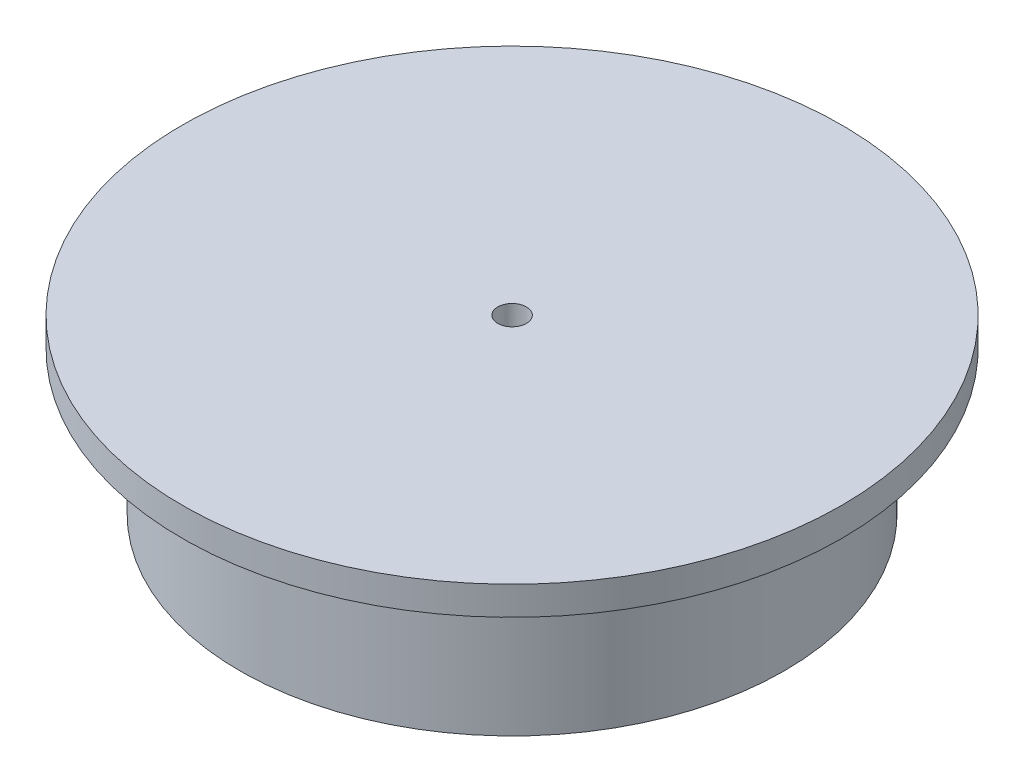
ISO-10303-21;
HEADER;
FILE_DESCRIPTION(('STEP AP214'),'2;1');
FILE_NAME('part.step','',(''),(''),'','','');
FILE_SCHEMA(('AUTOMOTIVE_DESIGN { 1 0 10303 214 1 1 1 1 }'));
ENDSEC;
DATA;
#1=APPLICATION_CONTEXT('core data for automotive mechanical design processes');
#2=APPLICATION_PROTOCOL_DEFINITION('international standard','automotive_design',2000,#1);
#3=PRODUCT_CONTEXT('',#1,'mechanical');
#4=PRODUCT('Part','Part','',(#3));
#5=PRODUCT_RELATED_PRODUCT_CATEGORY('part','',(#4));
#6=PRODUCT_DEFINITION_FORMATION('','',#4);
#7=PRODUCT_DEFINITION_CONTEXT('part definition',#1,'design');
#8=PRODUCT_DEFINITION('design','',#6,#7);
#9=PRODUCT_DEFINITION_SHAPE('','',#8);
#10=(LENGTH_UNIT() NAMED_UNIT(*) SI_UNIT(.MILLI.,.METRE.));
#11=(NAMED_UNIT(*) PLANE_ANGLE_UNIT() SI_UNIT($,.RADIAN.));
#12=(NAMED_UNIT(*) SI_UNIT($,.STERADIAN.) SOLID_ANGLE_UNIT());
#13=UNCERTAINTY_MEASURE_WITH_UNIT(LENGTH_MEASURE(1.E-05),#10,'distance_accuracy_value','');
#14=(GEOMETRIC_REPRESENTATION_CONTEXT(3) GLOBAL_UNCERTAINTY_ASSIGNED_CONTEXT((#13)) GLOBAL_UNIT_ASSIGNED_CONTEXT((#10,
#11,#12)) REPRESENTATION_CONTEXT('',''));
#15=CARTESIAN_POINT('',(0.,0.,0.));
#16=DIRECTION('',(0.,0.,1.));
#17=DIRECTION('',(1.,0.,0.));
#18=AXIS2_PLACEMENT_3D('',#15,#16,#17);
#19=CARTESIAN_POINT('',(0.,40.6119309075886,0.));
#20=DIRECTION('',(0.,-1.,0.));
#21=DIRECTION('',(1.,0.,0.));
#22=AXIS2_PLACEMENT_3D('',#19,#20,#21);
#23=CYLINDRICAL_SURFACE('',#22,57.5);
#24=CARTESIAN_POINT('',(0.,35.6119309075886,0.));
#25=DIRECTION('',(0.,-1.,0.));
#26=DIRECTION('',(1.,0.,0.));
#27=AXIS2_PLACEMENT_3D('',#24,#25,#26);
#28=CIRCLE('',#27,57.5);
#29=CARTESIAN_POINT('',(57.5,35.6119309075886,0.));
#30=VERTEX_POINT('',#29);
#31=EDGE_CURVE('E10',#30,#30,#28,.T.);
#32=ORIENTED_EDGE('',*,*,#31,.F.);
#33=EDGE_LOOP('',(#32));
#34=FACE_BOUND('',#33,.T.);
#35=CARTESIAN_POINT('',(0.,40.6119309075886,0.));
#36=DIRECTION('',(0.,-1.,0.));
#37=DIRECTION('',(1.,0.,0.));
#38=AXIS2_PLACEMENT_3D('',#35,#36,#37);
#39=CIRCLE('',#38,57.5);
#40=CARTESIAN_POINT('',(57.5,40.6119309075886,0.));
#41=VERTEX_POINT('',#40);
#42=EDGE_CURVE('E79',#41,#41,#39,.T.);
#43=ORIENTED_EDGE('',*,*,#42,.T.);
#44=EDGE_LOOP('',(#43));
#45=FACE_BOUND('',#44,.T.);
#46=ADVANCED_FACE('F44',(#34,#45),#23,.T.);
#47=CARTESIAN_POINT('',(0.,35.6119309075886,0.));
#48=DIRECTION('',(0.,1.,0.));
#49=DIRECTION('',(-1.,0.,0.));
#50=AXIS2_PLACEMENT_3D('',#47,#48,#49);
#51=PLANE('',#50);
#52=CARTESIAN_POINT('',(0.,35.6119309075886,0.));
#53=DIRECTION('',(0.,-1.,0.));
#54=DIRECTION('',(1.,0.,0.));
#55=AXIS2_PLACEMENT_3D('',#52,#53,#54);
#56=CIRCLE('',#55,47.5);
#57=CARTESIAN_POINT('',(47.5,35.6119309075886,0.));
#58=VERTEX_POINT('',#57);
#59=EDGE_CURVE('E52',#58,#58,#56,.T.);
#60=ORIENTED_EDGE('',*,*,#59,.F.);
#61=EDGE_LOOP('',(#60));
#62=FACE_BOUND('',#61,.T.);
#63=ORIENTED_EDGE('',*,*,#31,.T.);
#64=EDGE_LOOP('',(#63));
#65=FACE_BOUND('',#64,.T.);
#66=ADVANCED_FACE('F104',(#62,#65),#51,.F.);
#67=CARTESIAN_POINT('',(0.,40.6119309075886,0.));
#68=DIRECTION('',(0.,-1.,0.));
#69=DIRECTION('',(1.,0.,0.));
#70=AXIS2_PLACEMENT_3D('',#67,#68,#69);
#71=CYLINDRICAL_SURFACE('',#70,47.5);
#72=ORIENTED_EDGE('',*,*,#59,.T.);
#73=EDGE_LOOP('',(#72));
#74=FACE_BOUND('',#73,.T.);
#75=CARTESIAN_POINT('',(0.,10.6119309075886,0.));
#76=DIRECTION('',(0.,-1.,0.));
#77=DIRECTION('',(1.,0.,0.));
#78=AXIS2_PLACEMENT_3D('',#75,#76,#77);
#79=CIRCLE('',#78,47.5);
#80=CARTESIAN_POINT('',(47.5,10.6119309075886,0.));
#81=VERTEX_POINT('',#80);
#82=EDGE_CURVE('E57',#81,#81,#79,.T.);
#83=ORIENTED_EDGE('',*,*,#82,.F.);
#84=EDGE_LOOP('',(#83));
#85=FACE_BOUND('',#84,.T.);
#86=ADVANCED_FACE('F109',(#74,#85),#71,.T.);
#87=CARTESIAN_POINT('',(0.,10.6119309075886,0.));
#88=DIRECTION('',(0.,-1.,0.));
#89=DIRECTION('',(1.,0.,0.));
#90=AXIS2_PLACEMENT_3D('',#87,#88,#89);
#91=PLANE('',#90);
#92=ORIENTED_EDGE('',*,*,#82,.T.);
#93=EDGE_LOOP('',(#92));
#94=FACE_BOUND('',#93,.T.);
#95=CARTESIAN_POINT('',(0.,10.6119309075886,0.));
#96=DIRECTION('',(0.,-1.,0.));
#97=DIRECTION('',(1.,0.,0.));
#98=AXIS2_PLACEMENT_3D('',#95,#96,#97);
#99=CIRCLE('',#98,42.5);
#100=CARTESIAN_POINT('',(42.5,10.6119309075886,0.));
#101=VERTEX_POINT('',#100);
#102=EDGE_CURVE('E63',#101,#101,#99,.T.);
#103=ORIENTED_EDGE('',*,*,#102,.F.);
#104=EDGE_LOOP('',(#103));
#105=FACE_BOUND('',#104,.T.);
#106=ADVANCED_FACE('F116',(#94,#105),#91,.T.);
#107=CARTESIAN_POINT('',(0.,20.4880215522256,0.));
#108=DIRECTION('',(0.,-1.,0.));
#109=DIRECTION('',(1.,0.,0.));
#110=AXIS2_PLACEMENT_3D('',#107,#108,#109);
#111=CONICAL_SURFACE('',#110,32.623909355363,0.785398163397448);
#112=ORIENTED_EDGE('',*,*,#102,.T.);
#113=EDGE_LOOP('',(#112));
#114=FACE_BOUND('',#113,.T.);
#115=CARTESIAN_POINT('',(0.,20.4880215522256,0.));
#116=DIRECTION('',(0.,-1.,0.));
#117=DIRECTION('',(1.,0.,0.));
#118=AXIS2_PLACEMENT_3D('',#115,#116,#117);
#119=CIRCLE('',#118,32.623909355363);
#120=CARTESIAN_POINT('',(32.623909355363,20.4880215522256,0.));
#121=VERTEX_POINT('',#120);
#122=EDGE_CURVE('E67',#121,#121,#119,.T.);
#123=ORIENTED_EDGE('',*,*,#122,.F.);
#124=EDGE_LOOP('',(#123));
#125=FACE_BOUND('',#124,.T.);
#126=ADVANCED_FACE('F123',(#114,#125),#111,.F.);
#127=CARTESIAN_POINT('',(0.,10.3641121968625,0.));
#128=DIRECTION('',(0.,1.,0.));
#129=DIRECTION('',(-1.,0.,0.));
#130=AXIS2_PLACEMENT_3D('',#127,#128,#129);
#131=CONICAL_SURFACE('',#130,22.5,0.785398163397449);
#132=ORIENTED_EDGE('',*,*,#122,.T.);
#133=EDGE_LOOP('',(#132));
#134=FACE_BOUND('',#133,.T.);
#135=CARTESIAN_POINT('',(0.,10.3641121968625,0.));
#136=DIRECTION('',(0.,-1.,0.));
#137=DIRECTION('',(1.,0.,0.));
#138=AXIS2_PLACEMENT_3D('',#135,#136,#137);
#139=CIRCLE('',#138,22.5);
#140=CARTESIAN_POINT('',(22.5,10.3641121968625,0.));
#141=VERTEX_POINT('',#140);
#142=EDGE_CURVE('E71',#141,#141,#139,.T.);
#143=ORIENTED_EDGE('',*,*,#142,.F.);
#144=EDGE_LOOP('',(#143));
#145=FACE_BOUND('',#144,.T.);
#146=ADVANCED_FACE('F127',(#134,#145),#131,.T.);
#147=CARTESIAN_POINT('',(0.,20.1820560984313,0.));
#148=DIRECTION('',(0.,-1.,0.));
#149=DIRECTION('',(1.,0.,0.));
#150=AXIS2_PLACEMENT_3D('',#147,#148,#149);
#151=CONICAL_SURFACE('',#150,12.6820560984313,0.785398163397448);
#152=ORIENTED_EDGE('',*,*,#142,.T.);
#153=EDGE_LOOP('',(#152));
#154=FACE_BOUND('',#153,.T.);
#155=CARTESIAN_POINT('',(0.,20.1820560984313,0.));
#156=DIRECTION('',(0.,-1.,0.));
#157=DIRECTION('',(1.,0.,0.));
#158=AXIS2_PLACEMENT_3D('',#155,#156,#157);
#159=CIRCLE('',#158,12.6820560984313);
#160=CARTESIAN_POINT('',(12.6820560984313,20.1820560984313,0.));
#161=VERTEX_POINT('',#160);
#162=EDGE_CURVE('E75',#161,#161,#159,.T.);
#163=ORIENTED_EDGE('',*,*,#162,.F.);
#164=EDGE_LOOP('',(#163));
#165=FACE_BOUND('',#164,.T.);
#166=ADVANCED_FACE('F131',(#154,#165),#151,.F.);
#167=CARTESIAN_POINT('',(0.,10.,0.));
#168=DIRECTION('',(0.,1.,0.));
#169=DIRECTION('',(-1.,0.,0.));
#170=AXIS2_PLACEMENT_3D('',#167,#168,#169);
#171=CONICAL_SURFACE('',#170,2.5,0.785398163397448);
#172=ORIENTED_EDGE('',*,*,#162,.T.);
#173=EDGE_LOOP('',(#172));
#174=FACE_BOUND('',#173,.T.);
#175=CARTESIAN_POINT('',(0.,10.,0.));
#176=DIRECTION('',(0.,-1.,0.));
#177=DIRECTION('',(1.,0.,0.));
#178=AXIS2_PLACEMENT_3D('',#175,#176,#177);
#179=CIRCLE('',#178,2.5);
#180=CARTESIAN_POINT('',(2.5,10.,0.));
#181=VERTEX_POINT('',#180);
#182=EDGE_CURVE('E83',#181,#181,#179,.T.);
#183=ORIENTED_EDGE('',*,*,#182,.F.);
#184=EDGE_LOOP('',(#183));
#185=FACE_BOUND('',#184,.T.);
#186=ADVANCED_FACE('F101',(#174,#185),#171,.T.);
#187=CARTESIAN_POINT('',(0.,40.6119309075886,0.));
#188=DIRECTION('',(0.,-1.,0.));
#189=DIRECTION('',(1.,0.,0.));
#190=AXIS2_PLACEMENT_3D('',#187,#188,#189);
#191=PLANE('',#190);
#192=CARTESIAN_POINT('',(0.,40.6119309075886,0.));
#193=DIRECTION('',(0.,-1.,0.));
#194=DIRECTION('',(1.,0.,0.));
#195=AXIS2_PLACEMENT_3D('',#192,#193,#194);
#196=CIRCLE('',#195,2.5);
#197=CARTESIAN_POINT('',(2.5,40.6119309075886,0.));
#198=VERTEX_POINT('',#197);
#199=EDGE_CURVE('E47',#198,#198,#196,.T.);
#200=ORIENTED_EDGE('',*,*,#199,.T.);
#201=EDGE_LOOP('',(#200));
#202=FACE_BOUND('',#201,.T.);
#203=ORIENTED_EDGE('',*,*,#42,.F.);
#204=EDGE_LOOP('',(#203));
#205=FACE_BOUND('',#204,.T.);
#206=ADVANCED_FACE('F92',(#202,#205),#191,.F.);
#207=CARTESIAN_POINT('',(0.,50.,0.));
#208=DIRECTION('',(0.,-1.,0.));
#209=DIRECTION('',(1.,0.,0.));
#210=AXIS2_PLACEMENT_3D('',#207,#208,#209);
#211=CYLINDRICAL_SURFACE('',#210,2.5);
#212=ORIENTED_EDGE('',*,*,#182,.T.);
#213=EDGE_LOOP('',(#212));
#214=FACE_BOUND('',#213,.T.);
#215=ORIENTED_EDGE('',*,*,#199,.F.);
#216=EDGE_LOOP('',(#215));
#217=FACE_BOUND('',#216,.T.);
#218=ADVANCED_FACE('F95',(#214,#217),#211,.F.);
#219=CLOSED_SHELL('',(#46,#66,#86,#106,#126,#146,#166,#186,#206,#218));
#220=MANIFOLD_SOLID_BREP('B2',#219);
#221=ADVANCED_BREP_SHAPE_REPRESENTATION('',(#18,#220),#14);
#222=SHAPE_DEFINITION_REPRESENTATION(#9,#221);
ENDSEC;
END-ISO-10303-21;
